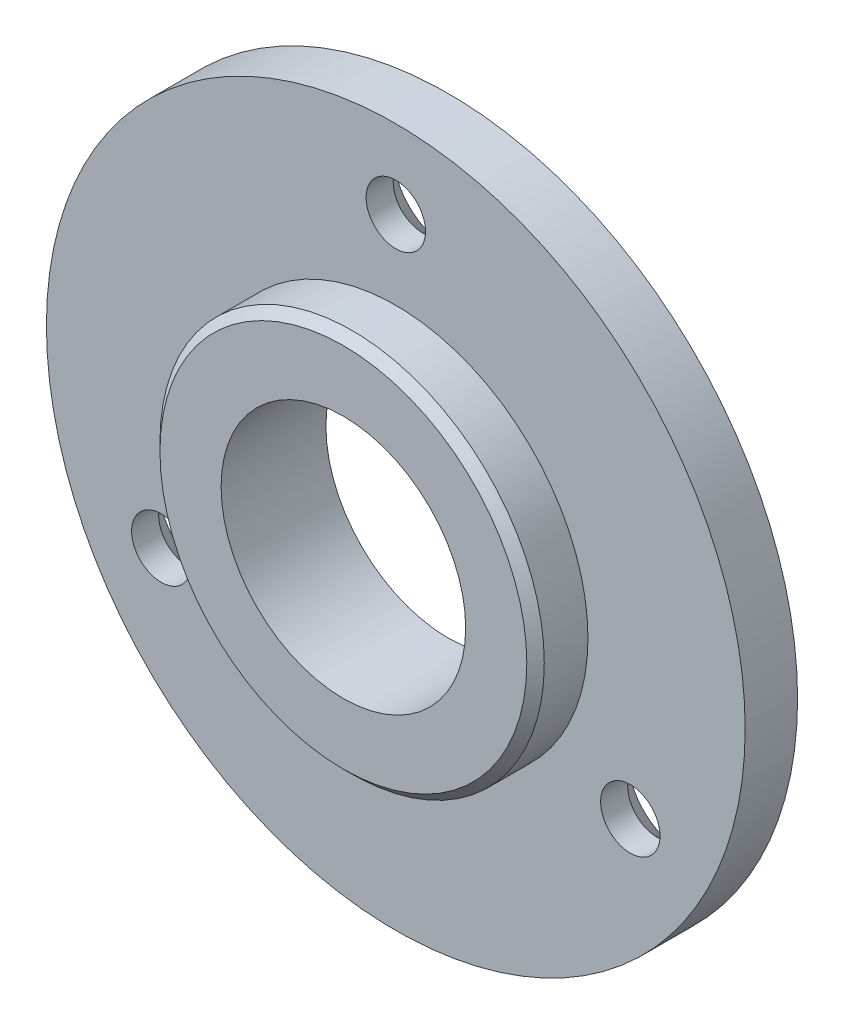
ISO-10303-21;
HEADER;
FILE_DESCRIPTION(('STEP AP214'),'2;1');
FILE_NAME('part.step','',(''),(''),'','','');
FILE_SCHEMA(('AUTOMOTIVE_DESIGN { 1 0 10303 214 1 1 1 1 }'));
ENDSEC;
DATA;
#1=APPLICATION_CONTEXT('core data for automotive mechanical design processes');
#2=APPLICATION_PROTOCOL_DEFINITION('international standard','automotive_design',2000,#1);
#3=PRODUCT_CONTEXT('',#1,'mechanical');
#4=PRODUCT('Part','Part','',(#3));
#5=PRODUCT_RELATED_PRODUCT_CATEGORY('part','',(#4));
#6=PRODUCT_DEFINITION_FORMATION('','',#4);
#7=PRODUCT_DEFINITION_CONTEXT('part definition',#1,'design');
#8=PRODUCT_DEFINITION('design','',#6,#7);
#9=PRODUCT_DEFINITION_SHAPE('','',#8);
#10=(LENGTH_UNIT() NAMED_UNIT(*) SI_UNIT(.MILLI.,.METRE.));
#11=(NAMED_UNIT(*) PLANE_ANGLE_UNIT() SI_UNIT($,.RADIAN.));
#12=(NAMED_UNIT(*) SI_UNIT($,.STERADIAN.) SOLID_ANGLE_UNIT());
#13=UNCERTAINTY_MEASURE_WITH_UNIT(LENGTH_MEASURE(1.E-05),#10,'distance_accuracy_value','');
#14=(GEOMETRIC_REPRESENTATION_CONTEXT(3) GLOBAL_UNCERTAINTY_ASSIGNED_CONTEXT((#13)) GLOBAL_UNIT_ASSIGNED_CONTEXT((#10,
#11,#12)) REPRESENTATION_CONTEXT('',''));
#15=CARTESIAN_POINT('',(0.,0.,0.));
#16=DIRECTION('',(0.,0.,1.));
#17=DIRECTION('',(1.,0.,0.));
#18=AXIS2_PLACEMENT_3D('',#15,#16,#17);
#19=CARTESIAN_POINT('',(0.,0.,0.));
#20=DIRECTION('',(0.,0.,1.));
#21=DIRECTION('',(1.,0.,0.));
#22=AXIS2_PLACEMENT_3D('',#19,#20,#21);
#23=PLANE('',#22);
#24=CARTESIAN_POINT('',(-13.4233937586589,-7.74999999999987,0.));
#25=DIRECTION('',(0.,0.,-1.));
#26=DIRECTION('',(-1.,0.,0.));
#27=AXIS2_PLACEMENT_3D('',#24,#25,#26);
#28=CIRCLE('',#27,3.15);
#29=CARTESIAN_POINT('',(-16.5733937586589,-7.74999999999987,0.));
#30=VERTEX_POINT('',#29);
#31=EDGE_CURVE('E208',#30,#30,#28,.T.);
#32=ORIENTED_EDGE('',*,*,#31,.F.);
#33=EDGE_LOOP('',(#32));
#34=FACE_BOUND('',#33,.T.);
#35=CARTESIAN_POINT('',(0.,0.,0.));
#36=DIRECTION('',(0.,0.,1.));
#37=DIRECTION('',(1.,0.,0.));
#38=AXIS2_PLACEMENT_3D('',#35,#36,#37);
#39=CIRCLE('',#38,20.);
#40=CARTESIAN_POINT('',(20.,0.,0.));
#41=VERTEX_POINT('',#40);
#42=EDGE_CURVE('E80',#41,#41,#39,.T.);
#43=ORIENTED_EDGE('',*,*,#42,.F.);
#44=EDGE_LOOP('',(#43));
#45=FACE_BOUND('',#44,.T.);
#46=CARTESIAN_POINT('',(0.,0.,0.));
#47=DIRECTION('',(0.,0.,-1.));
#48=DIRECTION('',(-1.,0.,0.));
#49=AXIS2_PLACEMENT_3D('',#46,#47,#48);
#50=CIRCLE('',#49,7.);
#51=CARTESIAN_POINT('',(-7.,0.,0.));
#52=VERTEX_POINT('',#51);
#53=EDGE_CURVE('E51',#52,#52,#50,.T.);
#54=ORIENTED_EDGE('',*,*,#53,.F.);
#55=EDGE_LOOP('',(#54));
#56=FACE_BOUND('',#55,.T.);
#57=CARTESIAN_POINT('',(0.,15.5,0.));
#58=DIRECTION('',(0.,0.,-1.));
#59=DIRECTION('',(-1.,0.,0.));
#60=AXIS2_PLACEMENT_3D('',#57,#58,#59);
#61=CIRCLE('',#60,3.15);
#62=CARTESIAN_POINT('',(-3.15,15.5,0.));
#63=VERTEX_POINT('',#62);
#64=EDGE_CURVE('E55',#63,#63,#61,.T.);
#65=ORIENTED_EDGE('',*,*,#64,.F.);
#66=EDGE_LOOP('',(#65));
#67=FACE_BOUND('',#66,.T.);
#68=CARTESIAN_POINT('',(13.4233937586588,-7.75000000000006,0.));
#69=DIRECTION('',(0.,0.,-1.));
#70=DIRECTION('',(-1.,0.,0.));
#71=AXIS2_PLACEMENT_3D('',#68,#69,#70);
#72=CIRCLE('',#71,3.15);
#73=CARTESIAN_POINT('',(10.2733937586588,-7.75000000000006,0.));
#74=VERTEX_POINT('',#73);
#75=EDGE_CURVE('E62',#74,#74,#72,.T.);
#76=ORIENTED_EDGE('',*,*,#75,.F.);
#77=EDGE_LOOP('',(#76));
#78=FACE_BOUND('',#77,.T.);
#79=ADVANCED_FACE('F32',(#34,#45,#56,#67,#78),#23,.F.);
#80=CARTESIAN_POINT('',(0.,0.,3.));
#81=DIRECTION('',(0.,0.,1.));
#82=DIRECTION('',(1.,0.,0.));
#83=AXIS2_PLACEMENT_3D('',#80,#81,#82);
#84=PLANE('',#83);
#85=CARTESIAN_POINT('',(-13.4233937586589,-7.74999999999987,3.));
#86=DIRECTION('',(0.,0.,1.));
#87=DIRECTION('',(1.,0.,0.));
#88=AXIS2_PLACEMENT_3D('',#85,#86,#87);
#89=CIRCLE('',#88,1.69999999999999);
#90=CARTESIAN_POINT('',(-11.7233937586589,-7.74999999999987,3.));
#91=VERTEX_POINT('',#90);
#92=EDGE_CURVE('E36',#91,#91,#89,.T.);
#93=ORIENTED_EDGE('',*,*,#92,.F.);
#94=EDGE_LOOP('',(#93));
#95=FACE_BOUND('',#94,.T.);
#96=CARTESIAN_POINT('',(13.4233937586588,-7.75000000000006,3.));
#97=DIRECTION('',(0.,0.,1.));
#98=DIRECTION('',(1.,0.,0.));
#99=AXIS2_PLACEMENT_3D('',#96,#97,#98);
#100=CIRCLE('',#99,1.69999999999999);
#101=CARTESIAN_POINT('',(15.1233937586588,-7.75000000000006,3.));
#102=VERTEX_POINT('',#101);
#103=EDGE_CURVE('E53',#102,#102,#100,.T.);
#104=ORIENTED_EDGE('',*,*,#103,.F.);
#105=EDGE_LOOP('',(#104));
#106=FACE_BOUND('',#105,.T.);
#107=CARTESIAN_POINT('',(0.,15.5,3.));
#108=DIRECTION('',(0.,0.,1.));
#109=DIRECTION('',(1.,0.,0.));
#110=AXIS2_PLACEMENT_3D('',#107,#108,#109);
#111=CIRCLE('',#110,1.69999999999999);
#112=CARTESIAN_POINT('',(1.69999999999999,15.5,3.));
#113=VERTEX_POINT('',#112);
#114=EDGE_CURVE('E49',#113,#113,#111,.T.);
#115=ORIENTED_EDGE('',*,*,#114,.F.);
#116=EDGE_LOOP('',(#115));
#117=FACE_BOUND('',#116,.T.);
#118=CARTESIAN_POINT('',(0.,0.,3.));
#119=DIRECTION('',(0.,0.,1.));
#120=DIRECTION('',(1.,0.,0.));
#121=AXIS2_PLACEMENT_3D('',#118,#119,#120);
#122=CIRCLE('',#121,20.);
#123=CARTESIAN_POINT('',(20.,0.,3.));
#124=VERTEX_POINT('',#123);
#125=EDGE_CURVE('E45',#124,#124,#122,.T.);
#126=ORIENTED_EDGE('',*,*,#125,.T.);
#127=EDGE_LOOP('',(#126));
#128=FACE_BOUND('',#127,.T.);
#129=CARTESIAN_POINT('',(0.,0.,3.));
#130=DIRECTION('',(0.,0.,1.));
#131=DIRECTION('',(1.,0.,0.));
#132=AXIS2_PLACEMENT_3D('',#129,#130,#131);
#133=CIRCLE('',#132,11.);
#134=CARTESIAN_POINT('',(11.,0.,3.));
#135=VERTEX_POINT('',#134);
#136=EDGE_CURVE('E75',#135,#135,#133,.T.);
#137=ORIENTED_EDGE('',*,*,#136,.F.);
#138=EDGE_LOOP('',(#137));
#139=FACE_BOUND('',#138,.T.);
#140=ADVANCED_FACE('F89',(#95,#106,#117,#128,#139),#84,.T.);
#141=CARTESIAN_POINT('',(0.,0.,3.));
#142=DIRECTION('',(0.,0.,-1.));
#143=DIRECTION('',(-1.,0.,0.));
#144=AXIS2_PLACEMENT_3D('',#141,#142,#143);
#145=CYLINDRICAL_SURFACE('',#144,20.);
#146=ORIENTED_EDGE('',*,*,#125,.F.);
#147=EDGE_LOOP('',(#146));
#148=FACE_BOUND('',#147,.T.);
#149=ORIENTED_EDGE('',*,*,#42,.T.);
#150=EDGE_LOOP('',(#149));
#151=FACE_BOUND('',#150,.T.);
#152=ADVANCED_FACE('F85',(#148,#151),#145,.T.);
#153=CARTESIAN_POINT('',(0.,0.,6.));
#154=DIRECTION('',(0.,0.,-1.));
#155=DIRECTION('',(-1.,0.,0.));
#156=AXIS2_PLACEMENT_3D('',#153,#154,#155);
#157=CYLINDRICAL_SURFACE('',#156,11.);
#158=CARTESIAN_POINT('',(0.,0.,5.5));
#159=DIRECTION('',(0.,0.,1.));
#160=DIRECTION('',(1.,0.,0.));
#161=AXIS2_PLACEMENT_3D('',#158,#159,#160);
#162=CIRCLE('',#161,11.);
#163=CARTESIAN_POINT('',(11.,0.,5.5));
#164=VERTEX_POINT('',#163);
#165=EDGE_CURVE('E10',#164,#164,#162,.F.);
#166=ORIENTED_EDGE('',*,*,#165,.T.);
#167=EDGE_LOOP('',(#166));
#168=FACE_BOUND('',#167,.T.);
#169=ORIENTED_EDGE('',*,*,#136,.T.);
#170=EDGE_LOOP('',(#169));
#171=FACE_BOUND('',#170,.T.);
#172=ADVANCED_FACE('F129',(#168,#171),#157,.T.);
#173=CARTESIAN_POINT('',(0.,0.,6.));
#174=DIRECTION('',(0.,0.,1.));
#175=DIRECTION('',(1.,0.,0.));
#176=AXIS2_PLACEMENT_3D('',#173,#174,#175);
#177=PLANE('',#176);
#178=CARTESIAN_POINT('',(0.,0.,6.));
#179=DIRECTION('',(0.,0.,-1.));
#180=DIRECTION('',(-1.,0.,0.));
#181=AXIS2_PLACEMENT_3D('',#178,#179,#180);
#182=CIRCLE('',#181,7.);
#183=CARTESIAN_POINT('',(-7.,0.,6.));
#184=VERTEX_POINT('',#183);
#185=EDGE_CURVE('E72',#184,#184,#182,.T.);
#186=ORIENTED_EDGE('',*,*,#185,.T.);
#187=EDGE_LOOP('',(#186));
#188=FACE_BOUND('',#187,.T.);
#189=CARTESIAN_POINT('',(0.,0.,6.));
#190=DIRECTION('',(0.,0.,1.));
#191=DIRECTION('',(1.,0.,0.));
#192=AXIS2_PLACEMENT_3D('',#189,#190,#191);
#193=CIRCLE('',#192,10.5);
#194=CARTESIAN_POINT('',(10.5,0.,6.));
#195=VERTEX_POINT('',#194);
#196=EDGE_CURVE('E40',#195,#195,#193,.T.);
#197=ORIENTED_EDGE('',*,*,#196,.T.);
#198=EDGE_LOOP('',(#197));
#199=FACE_BOUND('',#198,.T.);
#200=ADVANCED_FACE('F126',(#188,#199),#177,.T.);
#201=CARTESIAN_POINT('',(0.,0.,6.));
#202=DIRECTION('',(0.,0.,-1.));
#203=DIRECTION('',(-1.,0.,0.));
#204=AXIS2_PLACEMENT_3D('',#201,#202,#203);
#205=CONICAL_SURFACE('',#204,10.5,0.785398163397447);
#206=ORIENTED_EDGE('',*,*,#165,.F.);
#207=EDGE_LOOP('',(#206));
#208=FACE_BOUND('',#207,.T.);
#209=ORIENTED_EDGE('',*,*,#196,.F.);
#210=EDGE_LOOP('',(#209));
#211=FACE_BOUND('',#210,.T.);
#212=ADVANCED_FACE('F34',(#208,#211),#205,.T.);
#213=CARTESIAN_POINT('',(0.,0.,6.));
#214=DIRECTION('',(0.,0.,-1.));
#215=DIRECTION('',(-1.,0.,0.));
#216=AXIS2_PLACEMENT_3D('',#213,#214,#215);
#217=CYLINDRICAL_SURFACE('',#216,7.);
#218=ORIENTED_EDGE('',*,*,#185,.F.);
#219=EDGE_LOOP('',(#218));
#220=FACE_BOUND('',#219,.T.);
#221=ORIENTED_EDGE('',*,*,#53,.T.);
#222=EDGE_LOOP('',(#221));
#223=FACE_BOUND('',#222,.T.);
#224=ADVANCED_FACE('F121',(#220,#223),#217,.F.);
#225=CARTESIAN_POINT('',(0.,15.5,0.));
#226=DIRECTION('',(0.,0.,-1.));
#227=DIRECTION('',(-1.,0.,0.));
#228=AXIS2_PLACEMENT_3D('',#225,#226,#227);
#229=CYLINDRICAL_SURFACE('',#228,1.69999999999999);
#230=ORIENTED_EDGE('',*,*,#114,.T.);
#231=EDGE_LOOP('',(#230));
#232=FACE_BOUND('',#231,.T.);
#233=CARTESIAN_POINT('',(0.,15.5,1.45000000000001));
#234=DIRECTION('',(0.,0.,-1.));
#235=DIRECTION('',(-1.,0.,0.));
#236=AXIS2_PLACEMENT_3D('',#233,#234,#235);
#237=CIRCLE('',#236,1.69999999999999);
#238=CARTESIAN_POINT('',(-1.69999999999999,15.5,1.45000000000001));
#239=VERTEX_POINT('',#238);
#240=EDGE_CURVE('E52',#239,#239,#237,.T.);
#241=ORIENTED_EDGE('',*,*,#240,.T.);
#242=EDGE_LOOP('',(#241));
#243=FACE_BOUND('',#242,.T.);
#244=ADVANCED_FACE('F117',(#232,#243),#229,.F.);
#245=CARTESIAN_POINT('',(0.,15.5,0.));
#246=DIRECTION('',(0.,0.,-1.));
#247=DIRECTION('',(-1.,0.,0.));
#248=AXIS2_PLACEMENT_3D('',#245,#246,#247);
#249=CONICAL_SURFACE('',#248,3.15,0.78539816339745);
#250=ORIENTED_EDGE('',*,*,#240,.F.);
#251=EDGE_LOOP('',(#250));
#252=FACE_BOUND('',#251,.T.);
#253=ORIENTED_EDGE('',*,*,#64,.T.);
#254=EDGE_LOOP('',(#253));
#255=FACE_BOUND('',#254,.T.);
#256=ADVANCED_FACE('F111',(#252,#255),#249,.F.);
#257=CARTESIAN_POINT('',(13.4233937586588,-7.75000000000006,0.));
#258=DIRECTION('',(0.,0.,-1.));
#259=DIRECTION('',(-1.,0.,0.));
#260=AXIS2_PLACEMENT_3D('',#257,#258,#259);
#261=CYLINDRICAL_SURFACE('',#260,1.69999999999999);
#262=ORIENTED_EDGE('',*,*,#103,.T.);
#263=EDGE_LOOP('',(#262));
#264=FACE_BOUND('',#263,.T.);
#265=CARTESIAN_POINT('',(13.4233937586588,-7.75000000000006,1.45000000000001));
#266=DIRECTION('',(0.,0.,-1.));
#267=DIRECTION('',(-1.,0.,0.));
#268=AXIS2_PLACEMENT_3D('',#265,#266,#267);
#269=CIRCLE('',#268,1.69999999999999);
#270=CARTESIAN_POINT('',(11.7233937586588,-7.75000000000006,1.45000000000001));
#271=VERTEX_POINT('',#270);
#272=EDGE_CURVE('E56',#271,#271,#269,.T.);
#273=ORIENTED_EDGE('',*,*,#272,.T.);
#274=EDGE_LOOP('',(#273));
#275=FACE_BOUND('',#274,.T.);
#276=ADVANCED_FACE('F101',(#264,#275),#261,.F.);
#277=CARTESIAN_POINT('',(13.4233937586588,-7.75000000000006,0.));
#278=DIRECTION('',(0.,0.,-1.));
#279=DIRECTION('',(-1.,0.,0.));
#280=AXIS2_PLACEMENT_3D('',#277,#278,#279);
#281=CONICAL_SURFACE('',#280,3.15,0.78539816339745);
#282=ORIENTED_EDGE('',*,*,#272,.F.);
#283=EDGE_LOOP('',(#282));
#284=FACE_BOUND('',#283,.T.);
#285=ORIENTED_EDGE('',*,*,#75,.T.);
#286=EDGE_LOOP('',(#285));
#287=FACE_BOUND('',#286,.T.);
#288=ADVANCED_FACE('F98',(#284,#287),#281,.F.);
#289=CARTESIAN_POINT('',(-13.4233937586589,-7.74999999999987,0.));
#290=DIRECTION('',(0.,0.,-1.));
#291=DIRECTION('',(-1.,0.,0.));
#292=AXIS2_PLACEMENT_3D('',#289,#290,#291);
#293=CYLINDRICAL_SURFACE('',#292,1.69999999999999);
#294=ORIENTED_EDGE('',*,*,#92,.T.);
#295=EDGE_LOOP('',(#294));
#296=FACE_BOUND('',#295,.T.);
#297=CARTESIAN_POINT('',(-13.4233937586589,-7.74999999999987,1.45000000000001));
#298=DIRECTION('',(0.,0.,-1.));
#299=DIRECTION('',(-1.,0.,0.));
#300=AXIS2_PLACEMENT_3D('',#297,#298,#299);
#301=CIRCLE('',#300,1.69999999999999);
#302=CARTESIAN_POINT('',(-15.1233937586589,-7.74999999999987,1.45000000000001));
#303=VERTEX_POINT('',#302);
#304=EDGE_CURVE('E205',#303,#303,#301,.T.);
#305=ORIENTED_EDGE('',*,*,#304,.T.);
#306=EDGE_LOOP('',(#305));
#307=FACE_BOUND('',#306,.T.);
#308=ADVANCED_FACE('F100',(#296,#307),#293,.F.);
#309=CARTESIAN_POINT('',(-13.4233937586589,-7.74999999999987,0.));
#310=DIRECTION('',(0.,0.,-1.));
#311=DIRECTION('',(-1.,0.,0.));
#312=AXIS2_PLACEMENT_3D('',#309,#310,#311);
#313=CONICAL_SURFACE('',#312,3.15,0.78539816339745);
#314=ORIENTED_EDGE('',*,*,#304,.F.);
#315=EDGE_LOOP('',(#314));
#316=FACE_BOUND('',#315,.T.);
#317=ORIENTED_EDGE('',*,*,#31,.T.);
#318=EDGE_LOOP('',(#317));
#319=FACE_BOUND('',#318,.T.);
#320=ADVANCED_FACE('F108',(#316,#319),#313,.F.);
#321=CLOSED_SHELL('',(#79,#140,#152,#172,#200,#212,#224,#244,#256,#276,#288,#308,#320));
#322=MANIFOLD_SOLID_BREP('B2',#321);
#323=ADVANCED_BREP_SHAPE_REPRESENTATION('',(#18,#322),#14);
#324=SHAPE_DEFINITION_REPRESENTATION(#9,#323);
ENDSEC;
END-ISO-10303-21;
